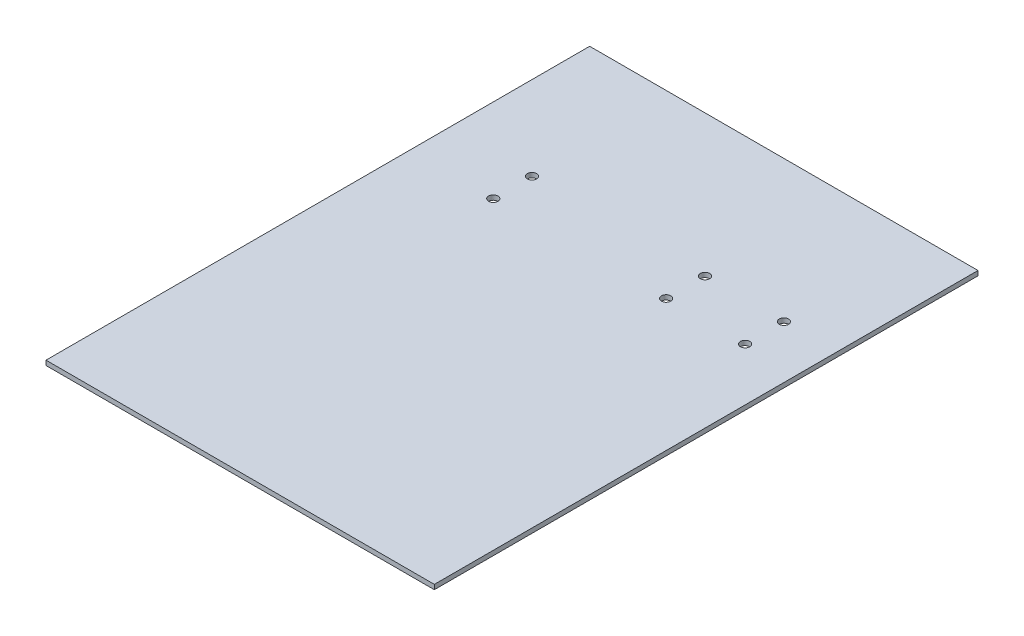
ISO-10303-21;
HEADER;
FILE_DESCRIPTION(('STEP AP214'),'2;1');
FILE_NAME('part.step','',(''),(''),'','','');
FILE_SCHEMA(('AUTOMOTIVE_DESIGN { 1 0 10303 214 1 1 1 1 }'));
ENDSEC;
DATA;
#1=APPLICATION_CONTEXT('core data for automotive mechanical design processes');
#2=APPLICATION_PROTOCOL_DEFINITION('international standard','automotive_design',2000,#1);
#3=PRODUCT_CONTEXT('',#1,'mechanical');
#4=PRODUCT('Part','Part','',(#3));
#5=PRODUCT_RELATED_PRODUCT_CATEGORY('part','',(#4));
#6=PRODUCT_DEFINITION_FORMATION('','',#4);
#7=PRODUCT_DEFINITION_CONTEXT('part definition',#1,'design');
#8=PRODUCT_DEFINITION('design','',#6,#7);
#9=PRODUCT_DEFINITION_SHAPE('','',#8);
#10=(LENGTH_UNIT() NAMED_UNIT(*) SI_UNIT(.MILLI.,.METRE.));
#11=(NAMED_UNIT(*) PLANE_ANGLE_UNIT() SI_UNIT($,.RADIAN.));
#12=(NAMED_UNIT(*) SI_UNIT($,.STERADIAN.) SOLID_ANGLE_UNIT());
#13=UNCERTAINTY_MEASURE_WITH_UNIT(LENGTH_MEASURE(1.E-05),#10,'distance_accuracy_value','');
#14=(GEOMETRIC_REPRESENTATION_CONTEXT(3) GLOBAL_UNCERTAINTY_ASSIGNED_CONTEXT((#13)) GLOBAL_UNIT_ASSIGNED_CONTEXT((#10,
#11,#12)) REPRESENTATION_CONTEXT('',''));
#15=CARTESIAN_POINT('',(0.,0.,0.));
#16=DIRECTION('',(0.,0.,1.));
#17=DIRECTION('',(1.,0.,0.));
#18=AXIS2_PLACEMENT_3D('',#15,#16,#17);
#19=CARTESIAN_POINT('',(0.,3.,0.));
#20=DIRECTION('',(1.,0.,0.));
#21=DIRECTION('',(0.,0.,-1.));
#22=AXIS2_PLACEMENT_3D('',#19,#20,#21);
#23=PLANE('',#22);
#24=DIRECTION('',(0.,0.,1.));
#25=VECTOR('',#24,1.);
#26=CARTESIAN_POINT('',(0.,0.,0.));
#27=LINE('',#26,#25);
#28=CARTESIAN_POINT('',(0.,0.,-350.));
#29=VERTEX_POINT('',#28);
#30=CARTESIAN_POINT('',(0.,0.,0.));
#31=VERTEX_POINT('',#30);
#32=EDGE_CURVE('E98',#29,#31,#27,.T.);
#33=ORIENTED_EDGE('',*,*,#32,.T.);
#34=DIRECTION('',(0.,-1.,0.));
#35=VECTOR('',#34,1.);
#36=CARTESIAN_POINT('',(0.,3.,0.));
#37=LINE('',#36,#35);
#38=CARTESIAN_POINT('',(0.,3.,0.));
#39=VERTEX_POINT('',#38);
#40=EDGE_CURVE('E11',#39,#31,#37,.T.);
#41=ORIENTED_EDGE('',*,*,#40,.F.);
#42=DIRECTION('',(0.,0.,1.));
#43=VECTOR('',#42,1.);
#44=CARTESIAN_POINT('',(0.,3.,0.));
#45=LINE('',#44,#43);
#46=CARTESIAN_POINT('',(0.,3.,-350.));
#47=VERTEX_POINT('',#46);
#48=EDGE_CURVE('E86',#47,#39,#45,.T.);
#49=ORIENTED_EDGE('',*,*,#48,.F.);
#50=DIRECTION('',(0.,-1.,0.));
#51=VECTOR('',#50,1.);
#52=CARTESIAN_POINT('',(0.,3.,-350.));
#53=LINE('',#52,#51);
#54=EDGE_CURVE('E94',#47,#29,#53,.T.);
#55=ORIENTED_EDGE('',*,*,#54,.T.);
#56=EDGE_LOOP('',(#33,#41,#49,#55));
#57=FACE_BOUND('',#56,.T.);
#58=ADVANCED_FACE('F35',(#57),#23,.F.);
#59=CARTESIAN_POINT('',(0.,3.,0.));
#60=DIRECTION('',(0.,0.,-1.));
#61=DIRECTION('',(-1.,0.,0.));
#62=AXIS2_PLACEMENT_3D('',#59,#60,#61);
#63=PLANE('',#62);
#64=DIRECTION('',(1.,0.,0.));
#65=VECTOR('',#64,1.);
#66=CARTESIAN_POINT('',(0.,0.,0.));
#67=LINE('',#66,#65);
#68=CARTESIAN_POINT('',(250.,0.,0.));
#69=VERTEX_POINT('',#68);
#70=EDGE_CURVE('E90',#31,#69,#67,.T.);
#71=ORIENTED_EDGE('',*,*,#70,.T.);
#72=DIRECTION('',(0.,-1.,0.));
#73=VECTOR('',#72,1.);
#74=CARTESIAN_POINT('',(250.,3.,0.));
#75=LINE('',#74,#73);
#76=CARTESIAN_POINT('',(250.,3.,0.));
#77=VERTEX_POINT('',#76);
#78=EDGE_CURVE('E43',#77,#69,#75,.T.);
#79=ORIENTED_EDGE('',*,*,#78,.F.);
#80=DIRECTION('',(1.,0.,0.));
#81=VECTOR('',#80,1.);
#82=CARTESIAN_POINT('',(0.,3.,0.));
#83=LINE('',#82,#81);
#84=EDGE_CURVE('E81',#39,#77,#83,.T.);
#85=ORIENTED_EDGE('',*,*,#84,.F.);
#86=ORIENTED_EDGE('',*,*,#40,.T.);
#87=EDGE_LOOP('',(#71,#79,#85,#86));
#88=FACE_BOUND('',#87,.T.);
#89=ADVANCED_FACE('F89',(#88),#63,.F.);
#90=CARTESIAN_POINT('',(250.,3.,0.));
#91=DIRECTION('',(-1.,0.,0.));
#92=DIRECTION('',(0.,0.,1.));
#93=AXIS2_PLACEMENT_3D('',#90,#91,#92);
#94=PLANE('',#93);
#95=DIRECTION('',(0.,0.,-1.));
#96=VECTOR('',#95,1.);
#97=CARTESIAN_POINT('',(250.,0.,0.));
#98=LINE('',#97,#96);
#99=CARTESIAN_POINT('',(250.,0.,-350.));
#100=VERTEX_POINT('',#99);
#101=EDGE_CURVE('E68',#69,#100,#98,.T.);
#102=ORIENTED_EDGE('',*,*,#101,.T.);
#103=DIRECTION('',(0.,-1.,0.));
#104=VECTOR('',#103,1.);
#105=CARTESIAN_POINT('',(250.,3.,-350.));
#106=LINE('',#105,#104);
#107=CARTESIAN_POINT('',(250.,3.,-350.));
#108=VERTEX_POINT('',#107);
#109=EDGE_CURVE('E91',#108,#100,#106,.T.);
#110=ORIENTED_EDGE('',*,*,#109,.F.);
#111=DIRECTION('',(0.,0.,-1.));
#112=VECTOR('',#111,1.);
#113=CARTESIAN_POINT('',(250.,3.,0.));
#114=LINE('',#113,#112);
#115=EDGE_CURVE('E84',#77,#108,#114,.T.);
#116=ORIENTED_EDGE('',*,*,#115,.F.);
#117=ORIENTED_EDGE('',*,*,#78,.T.);
#118=EDGE_LOOP('',(#102,#110,#116,#117));
#119=FACE_BOUND('',#118,.T.);
#120=ADVANCED_FACE('F92',(#119),#94,.F.);
#121=CARTESIAN_POINT('',(0.,3.,-350.));
#122=DIRECTION('',(0.,0.,1.));
#123=DIRECTION('',(1.,0.,0.));
#124=AXIS2_PLACEMENT_3D('',#121,#122,#123);
#125=PLANE('',#124);
#126=DIRECTION('',(-1.,0.,0.));
#127=VECTOR('',#126,1.);
#128=CARTESIAN_POINT('',(0.,0.,-350.));
#129=LINE('',#128,#127);
#130=EDGE_CURVE('E74',#100,#29,#129,.T.);
#131=ORIENTED_EDGE('',*,*,#130,.T.);
#132=ORIENTED_EDGE('',*,*,#54,.F.);
#133=DIRECTION('',(-1.,0.,0.));
#134=VECTOR('',#133,1.);
#135=CARTESIAN_POINT('',(0.,3.,-350.));
#136=LINE('',#135,#134);
#137=EDGE_CURVE('E51',#108,#47,#136,.T.);
#138=ORIENTED_EDGE('',*,*,#137,.F.);
#139=ORIENTED_EDGE('',*,*,#109,.T.);
#140=EDGE_LOOP('',(#131,#132,#138,#139));
#141=FACE_BOUND('',#140,.T.);
#142=ADVANCED_FACE('F106',(#141),#125,.F.);
#143=CARTESIAN_POINT('',(0.,3.,0.));
#144=DIRECTION('',(0.,-1.,0.));
#145=DIRECTION('',(0.,0.,-1.));
#146=AXIS2_PLACEMENT_3D('',#143,#144,#145);
#147=PLANE('',#146);
#148=CARTESIAN_POINT('',(53.9332044714154,3.,-259.000000000052));
#149=DIRECTION('',(0.,1.,0.));
#150=DIRECTION('',(0.,0.,1.));
#151=AXIS2_PLACEMENT_3D('',#148,#149,#150);
#152=CIRCLE('',#151,2.99999999999999);
#153=CARTESIAN_POINT('',(53.9332044714154,3.,-256.000000000052));
#154=VERTEX_POINT('',#153);
#155=EDGE_CURVE('E144',#154,#154,#152,.T.);
#156=ORIENTED_EDGE('',*,*,#155,.F.);
#157=EDGE_LOOP('',(#156));
#158=FACE_BOUND('',#157,.T.);
#159=CARTESIAN_POINT('',(53.9332044714154,3.,-234.000000000052));
#160=DIRECTION('',(0.,1.,0.));
#161=DIRECTION('',(0.,0.,1.));
#162=AXIS2_PLACEMENT_3D('',#159,#160,#161);
#163=CIRCLE('',#162,2.99999999999999);
#164=CARTESIAN_POINT('',(53.9332044714154,3.,-231.000000000052));
#165=VERTEX_POINT('',#164);
#166=EDGE_CURVE('E138',#165,#165,#163,.T.);
#167=ORIENTED_EDGE('',*,*,#166,.F.);
#168=EDGE_LOOP('',(#167));
#169=FACE_BOUND('',#168,.T.);
#170=CARTESIAN_POINT('',(165.242917031047,3.,-259.000000000051));
#171=DIRECTION('',(0.,-1.,0.));
#172=DIRECTION('',(0.,0.,-1.));
#173=AXIS2_PLACEMENT_3D('',#170,#171,#172);
#174=CIRCLE('',#173,2.99999999999999);
#175=CARTESIAN_POINT('',(165.242917031047,3.,-262.000000000051));
#176=VERTEX_POINT('',#175);
#177=EDGE_CURVE('E129',#176,#176,#174,.T.);
#178=ORIENTED_EDGE('',*,*,#177,.T.);
#179=EDGE_LOOP('',(#178));
#180=FACE_BOUND('',#179,.T.);
#181=CARTESIAN_POINT('',(216.072996175894,3.,-259.000000000051));
#182=DIRECTION('',(0.,-1.,0.));
#183=DIRECTION('',(0.,0.,-1.));
#184=AXIS2_PLACEMENT_3D('',#181,#182,#183);
#185=CIRCLE('',#184,3.);
#186=CARTESIAN_POINT('',(216.072996175894,3.,-262.000000000051));
#187=VERTEX_POINT('',#186);
#188=EDGE_CURVE('E123',#187,#187,#185,.T.);
#189=ORIENTED_EDGE('',*,*,#188,.T.);
#190=EDGE_LOOP('',(#189));
#191=FACE_BOUND('',#190,.T.);
#192=CARTESIAN_POINT('',(216.072996175894,3.,-234.000000000051));
#193=DIRECTION('',(0.,-1.,0.));
#194=DIRECTION('',(0.,0.,-1.));
#195=AXIS2_PLACEMENT_3D('',#192,#193,#194);
#196=CIRCLE('',#195,3.);
#197=CARTESIAN_POINT('',(216.072996175894,3.,-237.000000000051));
#198=VERTEX_POINT('',#197);
#199=EDGE_CURVE('E117',#198,#198,#196,.T.);
#200=ORIENTED_EDGE('',*,*,#199,.T.);
#201=EDGE_LOOP('',(#200));
#202=FACE_BOUND('',#201,.T.);
#203=CARTESIAN_POINT('',(165.242917031047,3.,-234.000000000051));
#204=DIRECTION('',(0.,-1.,0.));
#205=DIRECTION('',(0.,0.,-1.));
#206=AXIS2_PLACEMENT_3D('',#203,#204,#205);
#207=CIRCLE('',#206,3.);
#208=CARTESIAN_POINT('',(165.242917031047,3.,-237.000000000051));
#209=VERTEX_POINT('',#208);
#210=EDGE_CURVE('E101',#209,#209,#207,.T.);
#211=ORIENTED_EDGE('',*,*,#210,.T.);
#212=EDGE_LOOP('',(#211));
#213=FACE_BOUND('',#212,.T.);
#214=ORIENTED_EDGE('',*,*,#48,.T.);
#215=ORIENTED_EDGE('',*,*,#84,.T.);
#216=ORIENTED_EDGE('',*,*,#115,.T.);
#217=ORIENTED_EDGE('',*,*,#137,.T.);
#218=EDGE_LOOP('',(#214,#215,#216,#217));
#219=FACE_BOUND('',#218,.T.);
#220=ADVANCED_FACE('F82',(#158,#169,#180,#191,#202,#213,#219),#147,.F.);
#221=CARTESIAN_POINT('',(0.,0.,0.));
#222=DIRECTION('',(0.,-1.,0.));
#223=DIRECTION('',(0.,0.,-1.));
#224=AXIS2_PLACEMENT_3D('',#221,#222,#223);
#225=PLANE('',#224);
#226=CARTESIAN_POINT('',(53.9332044714154,0.,-259.000000000052));
#227=DIRECTION('',(0.,-1.,0.));
#228=DIRECTION('',(0.,0.,-1.));
#229=AXIS2_PLACEMENT_3D('',#226,#227,#228);
#230=CIRCLE('',#229,3.);
#231=CARTESIAN_POINT('',(53.9332044714154,0.,-262.000000000052));
#232=VERTEX_POINT('',#231);
#233=EDGE_CURVE('E141',#232,#232,#230,.T.);
#234=ORIENTED_EDGE('',*,*,#233,.F.);
#235=EDGE_LOOP('',(#234));
#236=FACE_BOUND('',#235,.T.);
#237=CARTESIAN_POINT('',(53.9332044714154,0.,-234.000000000052));
#238=DIRECTION('',(0.,-1.,0.));
#239=DIRECTION('',(0.,0.,-1.));
#240=AXIS2_PLACEMENT_3D('',#237,#238,#239);
#241=CIRCLE('',#240,3.);
#242=CARTESIAN_POINT('',(53.9332044714154,0.,-237.000000000052));
#243=VERTEX_POINT('',#242);
#244=EDGE_CURVE('E135',#243,#243,#241,.T.);
#245=ORIENTED_EDGE('',*,*,#244,.F.);
#246=EDGE_LOOP('',(#245));
#247=FACE_BOUND('',#246,.T.);
#248=CARTESIAN_POINT('',(165.242917031047,0.,-259.000000000051));
#249=DIRECTION('',(0.,-1.,0.));
#250=DIRECTION('',(0.,0.,-1.));
#251=AXIS2_PLACEMENT_3D('',#248,#249,#250);
#252=CIRCLE('',#251,2.99999999999998);
#253=CARTESIAN_POINT('',(165.242917031047,0.,-262.000000000051));
#254=VERTEX_POINT('',#253);
#255=EDGE_CURVE('E132',#254,#254,#252,.T.);
#256=ORIENTED_EDGE('',*,*,#255,.F.);
#257=EDGE_LOOP('',(#256));
#258=FACE_BOUND('',#257,.T.);
#259=CARTESIAN_POINT('',(216.072996175894,0.,-259.000000000051));
#260=DIRECTION('',(0.,-1.,0.));
#261=DIRECTION('',(0.,0.,-1.));
#262=AXIS2_PLACEMENT_3D('',#259,#260,#261);
#263=CIRCLE('',#262,3.);
#264=CARTESIAN_POINT('',(216.072996175894,0.,-262.000000000051));
#265=VERTEX_POINT('',#264);
#266=EDGE_CURVE('E126',#265,#265,#263,.T.);
#267=ORIENTED_EDGE('',*,*,#266,.F.);
#268=EDGE_LOOP('',(#267));
#269=FACE_BOUND('',#268,.T.);
#270=CARTESIAN_POINT('',(216.072996175894,0.,-234.000000000051));
#271=DIRECTION('',(0.,-1.,0.));
#272=DIRECTION('',(0.,0.,-1.));
#273=AXIS2_PLACEMENT_3D('',#270,#271,#272);
#274=CIRCLE('',#273,3.);
#275=CARTESIAN_POINT('',(216.072996175894,0.,-237.000000000051));
#276=VERTEX_POINT('',#275);
#277=EDGE_CURVE('E120',#276,#276,#274,.T.);
#278=ORIENTED_EDGE('',*,*,#277,.F.);
#279=EDGE_LOOP('',(#278));
#280=FACE_BOUND('',#279,.T.);
#281=CARTESIAN_POINT('',(165.242917031047,0.,-234.000000000051));
#282=DIRECTION('',(0.,-1.,0.));
#283=DIRECTION('',(0.,0.,-1.));
#284=AXIS2_PLACEMENT_3D('',#281,#282,#283);
#285=CIRCLE('',#284,3.);
#286=CARTESIAN_POINT('',(165.242917031047,0.,-237.000000000051));
#287=VERTEX_POINT('',#286);
#288=EDGE_CURVE('E114',#287,#287,#285,.T.);
#289=ORIENTED_EDGE('',*,*,#288,.F.);
#290=EDGE_LOOP('',(#289));
#291=FACE_BOUND('',#290,.T.);
#292=ORIENTED_EDGE('',*,*,#32,.F.);
#293=ORIENTED_EDGE('',*,*,#130,.F.);
#294=ORIENTED_EDGE('',*,*,#101,.F.);
#295=ORIENTED_EDGE('',*,*,#70,.F.);
#296=EDGE_LOOP('',(#292,#293,#294,#295));
#297=FACE_BOUND('',#296,.T.);
#298=ADVANCED_FACE('F109',(#236,#247,#258,#269,#280,#291,#297),#225,.T.);
#299=CARTESIAN_POINT('',(165.242917031047,0.,-234.000000000051));
#300=DIRECTION('',(0.,-1.,0.));
#301=DIRECTION('',(0.,0.,-1.));
#302=AXIS2_PLACEMENT_3D('',#299,#300,#301);
#303=CYLINDRICAL_SURFACE('',#302,3.);
#304=ORIENTED_EDGE('',*,*,#210,.F.);
#305=EDGE_LOOP('',(#304));
#306=FACE_BOUND('',#305,.T.);
#307=ORIENTED_EDGE('',*,*,#288,.T.);
#308=EDGE_LOOP('',(#307));
#309=FACE_BOUND('',#308,.T.);
#310=ADVANCED_FACE('F164',(#306,#309),#303,.F.);
#311=CARTESIAN_POINT('',(216.072996175894,0.,-234.000000000051));
#312=DIRECTION('',(0.,-1.,0.));
#313=DIRECTION('',(0.,0.,-1.));
#314=AXIS2_PLACEMENT_3D('',#311,#312,#313);
#315=CYLINDRICAL_SURFACE('',#314,3.);
#316=ORIENTED_EDGE('',*,*,#199,.F.);
#317=EDGE_LOOP('',(#316));
#318=FACE_BOUND('',#317,.T.);
#319=ORIENTED_EDGE('',*,*,#277,.T.);
#320=EDGE_LOOP('',(#319));
#321=FACE_BOUND('',#320,.T.);
#322=ADVANCED_FACE('F167',(#318,#321),#315,.F.);
#323=CARTESIAN_POINT('',(216.072996175894,0.,-259.000000000051));
#324=DIRECTION('',(0.,-1.,0.));
#325=DIRECTION('',(0.,0.,-1.));
#326=AXIS2_PLACEMENT_3D('',#323,#324,#325);
#327=CYLINDRICAL_SURFACE('',#326,3.);
#328=ORIENTED_EDGE('',*,*,#188,.F.);
#329=EDGE_LOOP('',(#328));
#330=FACE_BOUND('',#329,.T.);
#331=ORIENTED_EDGE('',*,*,#266,.T.);
#332=EDGE_LOOP('',(#331));
#333=FACE_BOUND('',#332,.T.);
#334=ADVANCED_FACE('F234',(#330,#333),#327,.F.);
#335=CARTESIAN_POINT('',(165.242917031047,0.,-259.000000000051));
#336=DIRECTION('',(0.,-1.,0.));
#337=DIRECTION('',(0.,0.,-1.));
#338=AXIS2_PLACEMENT_3D('',#335,#336,#337);
#339=CYLINDRICAL_SURFACE('',#338,2.99999999999999);
#340=ORIENTED_EDGE('',*,*,#177,.F.);
#341=EDGE_LOOP('',(#340));
#342=FACE_BOUND('',#341,.T.);
#343=ORIENTED_EDGE('',*,*,#255,.T.);
#344=EDGE_LOOP('',(#343));
#345=FACE_BOUND('',#344,.T.);
#346=ADVANCED_FACE('F205',(#342,#345),#339,.F.);
#347=CARTESIAN_POINT('',(53.9332044714154,3.,-234.000000000052));
#348=DIRECTION('',(0.,1.,0.));
#349=DIRECTION('',(0.,0.,1.));
#350=AXIS2_PLACEMENT_3D('',#347,#348,#349);
#351=CYLINDRICAL_SURFACE('',#350,3.);
#352=ORIENTED_EDGE('',*,*,#166,.T.);
#353=EDGE_LOOP('',(#352));
#354=FACE_BOUND('',#353,.T.);
#355=ORIENTED_EDGE('',*,*,#244,.T.);
#356=EDGE_LOOP('',(#355));
#357=FACE_BOUND('',#356,.T.);
#358=ADVANCED_FACE('F215',(#354,#357),#351,.F.);
#359=CARTESIAN_POINT('',(53.9332044714154,3.,-259.000000000052));
#360=DIRECTION('',(0.,1.,0.));
#361=DIRECTION('',(0.,0.,1.));
#362=AXIS2_PLACEMENT_3D('',#359,#360,#361);
#363=CYLINDRICAL_SURFACE('',#362,3.);
#364=ORIENTED_EDGE('',*,*,#155,.T.);
#365=EDGE_LOOP('',(#364));
#366=FACE_BOUND('',#365,.T.);
#367=ORIENTED_EDGE('',*,*,#233,.T.);
#368=EDGE_LOOP('',(#367));
#369=FACE_BOUND('',#368,.T.);
#370=ADVANCED_FACE('F148',(#366,#369),#363,.F.);
#371=CLOSED_SHELL('',(#58,#89,#120,#142,#220,#298,#310,#322,#334,#346,#358,#370));
#372=MANIFOLD_SOLID_BREP('B2',#371);
#373=ADVANCED_BREP_SHAPE_REPRESENTATION('',(#18,#372),#14);
#374=SHAPE_DEFINITION_REPRESENTATION(#9,#373);
ENDSEC;
END-ISO-10303-21;
